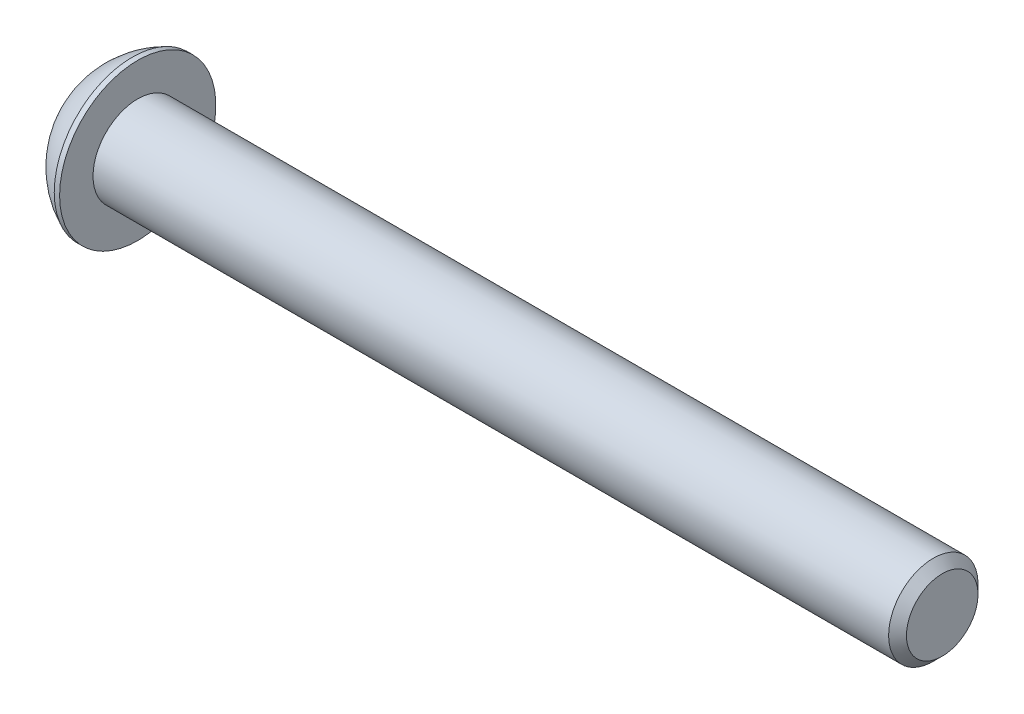
ISO-10303-21;
HEADER;
FILE_DESCRIPTION(('STEP AP214'),'2;1');
FILE_NAME('part.step','',(''),(''),'','','');
FILE_SCHEMA(('AUTOMOTIVE_DESIGN { 1 0 10303 214 1 1 1 1 }'));
ENDSEC;
DATA;
#1=APPLICATION_CONTEXT('core data for automotive mechanical design processes');
#2=APPLICATION_PROTOCOL_DEFINITION('international standard','automotive_design',2000,#1);
#3=PRODUCT_CONTEXT('',#1,'mechanical');
#4=PRODUCT('Part','Part','',(#3));
#5=PRODUCT_RELATED_PRODUCT_CATEGORY('part','',(#4));
#6=PRODUCT_DEFINITION_FORMATION('','',#4);
#7=PRODUCT_DEFINITION_CONTEXT('part definition',#1,'design');
#8=PRODUCT_DEFINITION('design','',#6,#7);
#9=PRODUCT_DEFINITION_SHAPE('','',#8);
#10=(LENGTH_UNIT() NAMED_UNIT(*) SI_UNIT(.MILLI.,.METRE.));
#11=(NAMED_UNIT(*) PLANE_ANGLE_UNIT() SI_UNIT($,.RADIAN.));
#12=(NAMED_UNIT(*) SI_UNIT($,.STERADIAN.) SOLID_ANGLE_UNIT());
#13=UNCERTAINTY_MEASURE_WITH_UNIT(LENGTH_MEASURE(1.E-05),#10,'distance_accuracy_value','');
#14=(GEOMETRIC_REPRESENTATION_CONTEXT(3) GLOBAL_UNCERTAINTY_ASSIGNED_CONTEXT((#13)) GLOBAL_UNIT_ASSIGNED_CONTEXT((#10,
#11,#12)) REPRESENTATION_CONTEXT('',''));
#15=CARTESIAN_POINT('',(0.,0.,0.));
#16=DIRECTION('',(0.,0.,1.));
#17=DIRECTION('',(1.,0.,0.));
#18=AXIS2_PLACEMENT_3D('',#15,#16,#17);
#19=CARTESIAN_POINT('',(1.32080000000034,0.,0.));
#20=DIRECTION('',(-1.,0.,0.));
#21=DIRECTION('',(0.,0.,1.));
#22=AXIS2_PLACEMENT_3D('',#19,#20,#21);
#23=CONICAL_SURFACE('',#22,1.1937999999998,1.04719755119608);
#24=CARTESIAN_POINT('',(2.01004075135902,0.,-4.44089209850063E-13));
#25=VERTEX_POINT('',#24);
#26=VERTEX_LOOP('',#25);
#27=FACE_BOUND('',#26,.T.);
#28=CARTESIAN_POINT('',(1.32080000000009,0.,0.));
#29=DIRECTION('',(-1.,0.,0.));
#30=DIRECTION('',(0.,0.,1.));
#31=AXIS2_PLACEMENT_3D('',#28,#29,#30);
#32=CIRCLE('',#31,1.19380000000024);
#33=CARTESIAN_POINT('',(1.32080000000009,0.,1.19380000000024));
#34=VERTEX_POINT('',#33);
#35=EDGE_CURVE('E20',#34,#34,#32,.T.);
#36=ORIENTED_EDGE('',*,*,#35,.T.);
#37=EDGE_LOOP('',(#36));
#38=FACE_BOUND('',#37,.T.);
#39=ADVANCED_FACE('F17',(#27,#38),#23,.F.);
#40=CARTESIAN_POINT('',(1.3208,-2.29135888084633,0.));
#41=DIRECTION('',(1.,0.,0.));
#42=DIRECTION('',(0.,0.,-1.));
#43=AXIS2_PLACEMENT_3D('',#40,#41,#42);
#44=PLANE('',#43);
#45=DIRECTION('',(0.,1.,0.));
#46=VECTOR('',#45,1.);
#47=CARTESIAN_POINT('',(1.3208,-1.14567944042316,1.984375));
#48=LINE('',#47,#46);
#49=CARTESIAN_POINT('',(1.3208,1.14567944042316,1.984375));
#50=VERTEX_POINT('',#49);
#51=CARTESIAN_POINT('',(1.3208,-1.14567944042316,1.984375));
#52=VERTEX_POINT('',#51);
#53=EDGE_CURVE('E69',#50,#52,#48,.F.);
#54=ORIENTED_EDGE('',*,*,#53,.F.);
#55=DIRECTION('',(0.,0.5,-0.866025403784439));
#56=VECTOR('',#55,1.);
#57=CARTESIAN_POINT('',(1.3208,1.14567944042316,1.984375));
#58=LINE('',#57,#56);
#59=CARTESIAN_POINT('',(1.3208,2.29135888084633,0.));
#60=VERTEX_POINT('',#59);
#61=EDGE_CURVE('E287',#60,#50,#58,.F.);
#62=ORIENTED_EDGE('',*,*,#61,.F.);
#63=DIRECTION('',(0.,-0.5,-0.866025403784439));
#64=VECTOR('',#63,1.);
#65=CARTESIAN_POINT('',(1.3208,2.29135888084633,0.));
#66=LINE('',#65,#64);
#67=CARTESIAN_POINT('',(1.3208,1.14567944042316,-1.984375));
#68=VERTEX_POINT('',#67);
#69=EDGE_CURVE('E291',#68,#60,#66,.F.);
#70=ORIENTED_EDGE('',*,*,#69,.F.);
#71=DIRECTION('',(0.,1.,0.));
#72=VECTOR('',#71,1.);
#73=CARTESIAN_POINT('',(1.3208,1.14567944042316,-1.984375));
#74=LINE('',#73,#72);
#75=CARTESIAN_POINT('',(1.3208,-1.14567944042316,-1.984375));
#76=VERTEX_POINT('',#75);
#77=EDGE_CURVE('E296',#76,#68,#74,.T.);
#78=ORIENTED_EDGE('',*,*,#77,.F.);
#79=DIRECTION('',(0.,-0.500000000000001,0.866025403784438));
#80=VECTOR('',#79,1.);
#81=CARTESIAN_POINT('',(1.3208,-1.14567944042316,-1.984375));
#82=LINE('',#81,#80);
#83=CARTESIAN_POINT('',(1.3208,-2.29135888084633,0.));
#84=VERTEX_POINT('',#83);
#85=EDGE_CURVE('E301',#84,#76,#82,.F.);
#86=ORIENTED_EDGE('',*,*,#85,.F.);
#87=DIRECTION('',(0.,0.500000000000001,0.866025403784438));
#88=VECTOR('',#87,1.);
#89=CARTESIAN_POINT('',(1.3208,-2.29135888084633,0.));
#90=LINE('',#89,#88);
#91=EDGE_CURVE('E82',#52,#84,#90,.F.);
#92=ORIENTED_EDGE('',*,*,#91,.F.);
#93=EDGE_LOOP('',(#54,#62,#70,#78,#86,#92));
#94=FACE_BOUND('',#93,.T.);
#95=ORIENTED_EDGE('',*,*,#35,.F.);
#96=EDGE_LOOP('',(#95));
#97=FACE_BOUND('',#96,.T.);
#98=ADVANCED_FACE('F75',(#94,#97),#44,.F.);
#99=CARTESIAN_POINT('',(1.3208,-1.14567944042316,1.984375));
#100=DIRECTION('',(0.,0.,-1.));
#101=DIRECTION('',(0.,1.,0.));
#102=AXIS2_PLACEMENT_3D('',#99,#100,#101);
#103=PLANE('',#102);
#104=ORIENTED_EDGE('',*,*,#53,.T.);
#105=DIRECTION('',(1.,0.,0.));
#106=VECTOR('',#105,1.);
#107=CARTESIAN_POINT('',(1.3208,-1.14567944042316,1.984375));
#108=LINE('',#107,#106);
#109=CARTESIAN_POINT('',(0.,-1.14567944042316,1.984375));
#110=VERTEX_POINT('',#109);
#111=EDGE_CURVE('E79',#110,#52,#108,.T.);
#112=ORIENTED_EDGE('',*,*,#111,.F.);
#113=DIRECTION('',(0.,1.,0.));
#114=VECTOR('',#113,1.);
#115=CARTESIAN_POINT('',(0.,0.,1.984375));
#116=LINE('',#115,#114);
#117=CARTESIAN_POINT('',(0.,1.14567944042316,1.984375));
#118=VERTEX_POINT('',#117);
#119=EDGE_CURVE('E281',#118,#110,#116,.F.);
#120=ORIENTED_EDGE('',*,*,#119,.F.);
#121=DIRECTION('',(1.,0.,0.));
#122=VECTOR('',#121,1.);
#123=CARTESIAN_POINT('',(1.3208,1.14567944042316,1.984375));
#124=LINE('',#123,#122);
#125=EDGE_CURVE('E284',#50,#118,#124,.F.);
#126=ORIENTED_EDGE('',*,*,#125,.F.);
#127=EDGE_LOOP('',(#104,#112,#120,#126));
#128=FACE_BOUND('',#127,.T.);
#129=ADVANCED_FACE('F128',(#128),#103,.T.);
#130=CARTESIAN_POINT('',(1.3208,-2.29135888084633,0.));
#131=DIRECTION('',(0.,0.866025403784438,-0.500000000000001));
#132=DIRECTION('',(0.,0.500000000000001,0.866025403784438));
#133=AXIS2_PLACEMENT_3D('',#130,#131,#132);
#134=PLANE('',#133);
#135=ORIENTED_EDGE('',*,*,#91,.T.);
#136=DIRECTION('',(1.,0.,0.));
#137=VECTOR('',#136,1.);
#138=CARTESIAN_POINT('',(1.3208,-2.29135888084633,0.));
#139=LINE('',#138,#137);
#140=CARTESIAN_POINT('',(0.,-2.29135888084633,0.));
#141=VERTEX_POINT('',#140);
#142=EDGE_CURVE('E303',#141,#84,#139,.T.);
#143=ORIENTED_EDGE('',*,*,#142,.F.);
#144=DIRECTION('',(0.,-0.500000000000001,-0.866025403784438));
#145=VECTOR('',#144,1.);
#146=CARTESIAN_POINT('',(0.,-1.14567944042316,1.984375));
#147=LINE('',#146,#145);
#148=EDGE_CURVE('E278',#110,#141,#147,.T.);
#149=ORIENTED_EDGE('',*,*,#148,.F.);
#150=ORIENTED_EDGE('',*,*,#111,.T.);
#151=EDGE_LOOP('',(#135,#143,#149,#150));
#152=FACE_BOUND('',#151,.T.);
#153=ADVANCED_FACE('F124',(#152),#134,.T.);
#154=CARTESIAN_POINT('',(1.3208,-1.14567944042316,-1.984375));
#155=DIRECTION('',(0.,0.866025403784438,0.500000000000001));
#156=DIRECTION('',(0.,-0.500000000000001,0.866025403784438));
#157=AXIS2_PLACEMENT_3D('',#154,#155,#156);
#158=PLANE('',#157);
#159=ORIENTED_EDGE('',*,*,#85,.T.);
#160=DIRECTION('',(1.,0.,0.));
#161=VECTOR('',#160,1.);
#162=CARTESIAN_POINT('',(1.3208,-1.14567944042316,-1.984375));
#163=LINE('',#162,#161);
#164=CARTESIAN_POINT('',(0.,-1.14567944042316,-1.984375));
#165=VERTEX_POINT('',#164);
#166=EDGE_CURVE('E298',#165,#76,#163,.T.);
#167=ORIENTED_EDGE('',*,*,#166,.F.);
#168=DIRECTION('',(0.,0.500000000000001,-0.866025403784438));
#169=VECTOR('',#168,1.);
#170=CARTESIAN_POINT('',(0.,-2.29135888084633,0.));
#171=LINE('',#170,#169);
#172=EDGE_CURVE('E275',#141,#165,#171,.T.);
#173=ORIENTED_EDGE('',*,*,#172,.F.);
#174=ORIENTED_EDGE('',*,*,#142,.T.);
#175=EDGE_LOOP('',(#159,#167,#173,#174));
#176=FACE_BOUND('',#175,.T.);
#177=ADVANCED_FACE('F120',(#176),#158,.T.);
#178=CARTESIAN_POINT('',(1.3208,1.14567944042316,-1.984375));
#179=DIRECTION('',(0.,0.,1.));
#180=DIRECTION('',(1.,0.,0.));
#181=AXIS2_PLACEMENT_3D('',#178,#179,#180);
#182=PLANE('',#181);
#183=ORIENTED_EDGE('',*,*,#77,.T.);
#184=DIRECTION('',(1.,0.,0.));
#185=VECTOR('',#184,1.);
#186=CARTESIAN_POINT('',(1.3208,1.14567944042316,-1.984375));
#187=LINE('',#186,#185);
#188=CARTESIAN_POINT('',(0.,1.14567944042316,-1.984375));
#189=VERTEX_POINT('',#188);
#190=EDGE_CURVE('E293',#189,#68,#187,.T.);
#191=ORIENTED_EDGE('',*,*,#190,.F.);
#192=DIRECTION('',(0.,1.,0.));
#193=VECTOR('',#192,1.);
#194=CARTESIAN_POINT('',(0.,0.,-1.984375));
#195=LINE('',#194,#193);
#196=EDGE_CURVE('E272',#165,#189,#195,.T.);
#197=ORIENTED_EDGE('',*,*,#196,.F.);
#198=ORIENTED_EDGE('',*,*,#166,.T.);
#199=EDGE_LOOP('',(#183,#191,#197,#198));
#200=FACE_BOUND('',#199,.T.);
#201=ADVANCED_FACE('F117',(#200),#182,.T.);
#202=CARTESIAN_POINT('',(1.3208,2.29135888084633,0.));
#203=DIRECTION('',(0.,-0.866025403784439,0.5));
#204=DIRECTION('',(0.,-0.5,-0.866025403784439));
#205=AXIS2_PLACEMENT_3D('',#202,#203,#204);
#206=PLANE('',#205);
#207=ORIENTED_EDGE('',*,*,#69,.T.);
#208=DIRECTION('',(1.,0.,0.));
#209=VECTOR('',#208,1.);
#210=CARTESIAN_POINT('',(1.3208,2.29135888084633,0.));
#211=LINE('',#210,#209);
#212=CARTESIAN_POINT('',(0.,2.29135888084633,0.));
#213=VERTEX_POINT('',#212);
#214=EDGE_CURVE('E35',#213,#60,#211,.T.);
#215=ORIENTED_EDGE('',*,*,#214,.F.);
#216=DIRECTION('',(0.,0.5,0.866025403784439));
#217=VECTOR('',#216,1.);
#218=CARTESIAN_POINT('',(0.,1.14567944042316,-1.984375));
#219=LINE('',#218,#217);
#220=EDGE_CURVE('E269',#189,#213,#219,.T.);
#221=ORIENTED_EDGE('',*,*,#220,.F.);
#222=ORIENTED_EDGE('',*,*,#190,.T.);
#223=EDGE_LOOP('',(#207,#215,#221,#222));
#224=FACE_BOUND('',#223,.T.);
#225=ADVANCED_FACE('F113',(#224),#206,.T.);
#226=CARTESIAN_POINT('',(1.3208,1.14567944042316,1.984375));
#227=DIRECTION('',(0.,-0.866025403784439,-0.5));
#228=DIRECTION('',(0.,0.5,-0.866025403784439));
#229=AXIS2_PLACEMENT_3D('',#226,#227,#228);
#230=PLANE('',#229);
#231=ORIENTED_EDGE('',*,*,#61,.T.);
#232=ORIENTED_EDGE('',*,*,#125,.T.);
#233=DIRECTION('',(0.,-0.5,0.866025403784438));
#234=VECTOR('',#233,1.);
#235=CARTESIAN_POINT('',(0.,2.29135888084633,0.));
#236=LINE('',#235,#234);
#237=EDGE_CURVE('E100',#213,#118,#236,.T.);
#238=ORIENTED_EDGE('',*,*,#237,.F.);
#239=ORIENTED_EDGE('',*,*,#214,.T.);
#240=EDGE_LOOP('',(#231,#232,#238,#239));
#241=FACE_BOUND('',#240,.T.);
#242=ADVANCED_FACE('F109',(#241),#230,.T.);
#243=CARTESIAN_POINT('',(0.,0.,0.));
#244=DIRECTION('',(-1.,0.,0.));
#245=DIRECTION('',(0.,0.,1.));
#246=AXIS2_PLACEMENT_3D('',#243,#244,#245);
#247=PLANE('',#246);
#248=ORIENTED_EDGE('',*,*,#220,.T.);
#249=ORIENTED_EDGE('',*,*,#237,.T.);
#250=ORIENTED_EDGE('',*,*,#119,.T.);
#251=ORIENTED_EDGE('',*,*,#148,.T.);
#252=ORIENTED_EDGE('',*,*,#172,.T.);
#253=ORIENTED_EDGE('',*,*,#196,.T.);
#254=EDGE_LOOP('',(#248,#249,#250,#251,#252,#253));
#255=FACE_BOUND('',#254,.T.);
#256=CARTESIAN_POINT('',(0.,2.77495,0.));
#257=CARTESIAN_POINT('',(0.,2.77494953309947,0.0779118937523459));
#258=CARTESIAN_POINT('',(0.,2.77166578388025,0.15583810591977));
#259=CARTESIAN_POINT('',(0.,2.75855213600204,0.311152012455904));
#260=CARTESIAN_POINT('',(0.,2.74872030471467,0.388539541019556));
#261=CARTESIAN_POINT('',(0.,2.72255472645676,0.542341518735717));
#262=CARTESIAN_POINT('',(-2.70414110576258E-13,2.70621065843663,0.618754223567578));
#263=CARTESIAN_POINT('',(2.71501725221868E-13,2.66713326915777,0.769973634286023));
#264=CARTESIAN_POINT('',(1.01274952524446E-12,2.64439476297869,0.844778983646282));
#265=CARTESIAN_POINT('',(1.81909959813207E-12,2.56690195943351,1.06566239301792));
#266=CARTESIAN_POINT('',(4.77081687541822E-13,2.50280672569928,1.20857954243987));
#267=CARTESIAN_POINT('',(-4.76232447128612E-13,2.35149826934097,1.48160874561538));
#268=CARTESIAN_POINT('',(0.,2.26428416790397,1.61172031233499));
#269=CARTESIAN_POINT('',(0.,2.1181093928834,1.79445660654268));
#270=CARTESIAN_POINT('',(0.,2.06678693791626,1.85333128513996));
#271=CARTESIAN_POINT('',(0.,1.95940522984449,1.96650727912792));
#272=CARTESIAN_POINT('',(0.,1.90335059143535,2.02081294920044));
#273=CARTESIAN_POINT('',(0.,1.78683891013963,2.12453280878582));
#274=CARTESIAN_POINT('',(0.,1.72637988450322,2.1739447713554));
#275=CARTESIAN_POINT('',(0.,1.60151968865711,2.26750481692908));
#276=CARTESIAN_POINT('',(0.,1.53711760864537,2.31165167810847));
#277=CARTESIAN_POINT('',(0.,1.33869902291632,2.43567242603944));
#278=CARTESIAN_POINT('',(0.,1.19934704110695,2.507235886628));
#279=CARTESIAN_POINT('',(0.,0.910681609121881,2.62590828672821));
#280=CARTESIAN_POINT('',(0.,0.761368265357398,2.67301748742278));
#281=CARTESIAN_POINT('',(0.,0.456932649466623,2.74151230664007));
#282=CARTESIAN_POINT('',(0.,0.301810346322584,2.76289778778721));
#283=CARTESIAN_POINT('',(0.,-0.00982263870895171,2.77931595661156));
#284=CARTESIAN_POINT('',(0.,-0.166333320596448,2.77434864428877));
#285=CARTESIAN_POINT('',(0.,-0.476280836814452,2.73822217653073));
#286=CARTESIAN_POINT('',(0.,-0.629717687555985,2.70706316096981));
#287=CARTESIAN_POINT('',(0.,-0.929254830044274,2.61937980771149));
#288=CARTESIAN_POINT('',(0.,-1.0753550434132,2.56285519909568));
#289=CARTESIAN_POINT('',(0.,-1.28570692598579,2.46037024128109));
#290=CARTESIAN_POINT('',(0.,-1.35439130022287,2.42323494812896));
#291=CARTESIAN_POINT('',(0.,-1.488391287199,2.34331277270256));
#292=CARTESIAN_POINT('',(0.,-1.55370767631787,2.30052720108831));
#293=CARTESIAN_POINT('',(0.,-1.68047292776594,2.20962421887055));
#294=CARTESIAN_POINT('',(0.,-1.7419235278682,2.16150923122348));
#295=CARTESIAN_POINT('',(0.,-1.86060297067992,2.06024311301283));
#296=CARTESIAN_POINT('',(0.,-1.91782768181715,2.0070871669763));
#297=CARTESIAN_POINT('',(0.,-2.08239462196651,1.8407220856554));
#298=CARTESIAN_POINT('',(0.,-2.18279764272601,1.72049499758422));
#299=CARTESIAN_POINT('',(0.,-2.36195754944063,1.46487629213018));
#300=CARTESIAN_POINT('',(0.,-2.44071525816758,1.32948525142807));
#301=CARTESIAN_POINT('',(0.,-2.54098882695274,1.11796734074395));
#302=CARTESIAN_POINT('',(0.,-2.57146177392727,1.04596540008347));
#303=CARTESIAN_POINT('',(0.,-2.62621251108999,0.899689259475764));
#304=CARTESIAN_POINT('',(0.,-2.65049531495563,0.825416953360952));
#305=CARTESIAN_POINT('',(0.,-2.69267708798766,0.675215808695207));
#306=CARTESIAN_POINT('',(0.,-2.71058613777937,0.599289789313092));
#307=CARTESIAN_POINT('',(0.,-2.73994710360127,0.446213628496932));
#308=CARTESIAN_POINT('',(0.,-2.75140092413871,0.369063855024788));
#309=CARTESIAN_POINT('',(0.,-2.76470470685522,0.24316208817343));
#310=CARTESIAN_POINT('',(0.,-2.76854547596618,0.194611672428577));
#311=CARTESIAN_POINT('',(0.,-2.77366826843264,0.0973760351839812));
#312=CARTESIAN_POINT('',(0.,-2.77495029178814,0.0486908136842395));
#313=CARTESIAN_POINT('',(0.,-2.77494953309947,-0.0779118937523475));
#314=CARTESIAN_POINT('',(0.,-2.77166578388025,-0.155838105919772));
#315=CARTESIAN_POINT('',(0.,-2.75855213600204,-0.311152012455906));
#316=CARTESIAN_POINT('',(0.,-2.74872030471467,-0.388539541019558));
#317=CARTESIAN_POINT('',(0.,-2.72255472645677,-0.542341518735719));
#318=CARTESIAN_POINT('',(-2.70149297926331E-13,-2.70621065843663,-0.61875422356758));
#319=CARTESIAN_POINT('',(2.712366972268E-13,-2.66713326915777,-0.769973634286024));
#320=CARTESIAN_POINT('',(1.0114146773846E-12,-2.64439476297869,-0.844778983646283));
#321=CARTESIAN_POINT('',(1.81656702958366E-12,-2.5669019594335,-1.06566239301792));
#322=CARTESIAN_POINT('',(4.7641829195856E-13,-2.50280672569928,-1.20857954243988));
#323=CARTESIAN_POINT('',(-4.75569026324205E-13,-2.35149826934097,-1.48160874561538));
#324=CARTESIAN_POINT('',(0.,-2.26428416790396,-1.61172031233499));
#325=CARTESIAN_POINT('',(0.,-2.1181093928834,-1.79445660654268));
#326=CARTESIAN_POINT('',(0.,-2.06678693791626,-1.85333128513997));
#327=CARTESIAN_POINT('',(0.,-1.95940522984449,-1.96650727912792));
#328=CARTESIAN_POINT('',(0.,-1.90335059143535,-2.02081294920044));
#329=CARTESIAN_POINT('',(0.,-1.78683891013963,-2.12453280878582));
#330=CARTESIAN_POINT('',(0.,-1.72637988450322,-2.1739447713554));
#331=CARTESIAN_POINT('',(0.,-1.60151968865711,-2.26750481692908));
#332=CARTESIAN_POINT('',(0.,-1.53711760864537,-2.31165167810847));
#333=CARTESIAN_POINT('',(0.,-1.33869902291632,-2.43567242603944));
#334=CARTESIAN_POINT('',(0.,-1.19934704110695,-2.507235886628));
#335=CARTESIAN_POINT('',(0.,-0.91068160912188,-2.62590828672821));
#336=CARTESIAN_POINT('',(0.,-0.761368265357396,-2.67301748742278));
#337=CARTESIAN_POINT('',(0.,-0.456932649466621,-2.74151230664007));
#338=CARTESIAN_POINT('',(0.,-0.301810346322582,-2.76289778778721));
#339=CARTESIAN_POINT('',(0.,0.00982263870895353,-2.77931595661156));
#340=CARTESIAN_POINT('',(0.,0.16633332059645,-2.77434864428876));
#341=CARTESIAN_POINT('',(0.,0.476280836814454,-2.73822217653073));
#342=CARTESIAN_POINT('',(0.,0.629717687555987,-2.70706316096981));
#343=CARTESIAN_POINT('',(0.,0.929254830044276,-2.6193798077115));
#344=CARTESIAN_POINT('',(0.,1.0753550434132,-2.56285519909568));
#345=CARTESIAN_POINT('',(0.,1.28570692598579,-2.46037024128109));
#346=CARTESIAN_POINT('',(0.,1.35439130022287,-2.42323494812896));
#347=CARTESIAN_POINT('',(0.,1.488391287199,-2.34331277270256));
#348=CARTESIAN_POINT('',(0.,1.55370767631787,-2.30052720108831));
#349=CARTESIAN_POINT('',(0.,1.68047292776594,-2.20962421887055));
#350=CARTESIAN_POINT('',(0.,1.7419235278682,-2.16150923122348));
#351=CARTESIAN_POINT('',(0.,1.86060297067992,-2.06024311301282));
#352=CARTESIAN_POINT('',(0.,1.91782768181716,-2.0070871669763));
#353=CARTESIAN_POINT('',(0.,2.08239462196651,-1.8407220856554));
#354=CARTESIAN_POINT('',(0.,2.18279764272601,-1.72049499758422));
#355=CARTESIAN_POINT('',(0.,2.36195754944063,-1.46487629213018));
#356=CARTESIAN_POINT('',(0.,2.44071525816757,-1.32948525142807));
#357=CARTESIAN_POINT('',(0.,2.54098882695273,-1.11796734074395));
#358=CARTESIAN_POINT('',(0.,2.57146177392727,-1.04596540008347));
#359=CARTESIAN_POINT('',(0.,2.62621251108999,-0.899689259475765));
#360=CARTESIAN_POINT('',(0.,2.65049531495563,-0.825416953360953));
#361=CARTESIAN_POINT('',(0.,2.69267708798766,-0.675215808695207));
#362=CARTESIAN_POINT('',(0.,2.71058613777936,-0.599289789313092));
#363=CARTESIAN_POINT('',(0.,2.73994710360127,-0.446213628496932));
#364=CARTESIAN_POINT('',(0.,2.75140092413871,-0.369063855024789));
#365=CARTESIAN_POINT('',(0.,2.76470470685522,-0.243162088173432));
#366=CARTESIAN_POINT('',(0.,2.76854547596618,-0.194611672428578));
#367=CARTESIAN_POINT('',(0.,2.77366826843264,-0.0973760351839823));
#368=CARTESIAN_POINT('',(0.,2.77495029178814,-0.0486908136842408));
#369=CARTESIAN_POINT('',(0.,2.77495,0.));
#370=B_SPLINE_CURVE_WITH_KNOTS('',3,(#256,#257,#258,#259,#260,#261,#262,#263,#264,#265,#266,
#267,#268,#269,#270,#271,#272,#273,#274,#275,#276,#277,#278,#279,#280,#281,#282,#283,#284,#285,
#286,#287,#288,#289,#290,#291,#292,#293,#294,#295,#296,#297,#298,#299,#300,#301,#302,#303,#304,
#305,#306,#307,#308,#309,#310,#311,#312,#313,#314,#315,#316,#317,#318,#319,#320,#321,#322,#323,
#324,#325,#326,#327,#328,#329,#330,#331,#332,#333,#334,#335,#336,#337,#338,#339,#340,#341,#342,
#343,#344,#345,#346,#347,#348,#349,#350,#351,#352,#353,#354,#355,#356,#357,#358,#359,#360,#361,
#362,#363,#364,#365,#366,#367,#368,#369),.UNSPECIFIED.,.T.,.F.,(4,2,2,2,2,2,2,2,2,2,2,2,2,2,2,2,
2,2,2,2,2,2,2,2,2,2,2,2,2,2,2,2,2,2,2,2,2,2,2,2,2,2,2,2,2,2,2,2,2,2,2,2,2,2,2,2,4),(0.,
0.233690856748162,0.467450716578751,0.701582538521471,0.935904756015414,1.40343220467667,
1.87097742791502,2.10505636898837,2.33890962270652,2.57286880998746,2.80688218486306,
3.27442101763127,3.74195485676357,4.20949119271389,4.67702752866417,5.14456136779641,
5.61210020056468,5.84611357544033,6.08007276272136,6.31392601643949,6.54800495751273,
7.01555018075072,7.48307762941212,7.71739984690652,7.95153166884955,8.18529152868023,
8.41898238542855,8.56502681353347,8.71107124163843,8.94476209838659,9.17852195821718,
9.4126537801599,9.64697599765384,10.1145034463151,10.5820486695534,10.8161276106268,
11.0499808643449,11.2839400516259,11.5179534265015,11.9854922592697,12.453026098402,
12.9205624343523,13.3880987703026,13.8556326094348,14.3231714422031,14.5571848170788,
14.7911440043598,15.0249972580779,15.2590761991512,15.7266214223891,16.1941488710506,
16.4284710885449,16.662602910488,16.8963627703186,17.130053627067,17.2760980551719,
17.4221424832769),.UNSPECIFIED.);
#371=CARTESIAN_POINT('',(0.,2.77495,0.));
#372=VERTEX_POINT('',#371);
#373=EDGE_CURVE('E94',#372,#372,#370,.T.);
#374=ORIENTED_EDGE('',*,*,#373,.F.);
#375=EDGE_LOOP('',(#374));
#376=FACE_BOUND('',#375,.T.);
#377=ADVANCED_FACE('F105',(#255,#376),#247,.T.);
#378=CARTESIAN_POINT('',(5.37260881410256,0.,0.));
#379=DIRECTION('',(0.,1.,0.));
#380=DIRECTION('',(1.,0.,0.));
#381=AXIS2_PLACEMENT_3D('',#378,#379,#380);
#382=SPHERICAL_SURFACE('',#381,6.04692260342999);
#383=CARTESIAN_POINT('',(2.9718,0.,0.));
#384=DIRECTION('',(-1.,0.,0.));
#385=DIRECTION('',(0.,0.,1.));
#386=AXIS2_PLACEMENT_3D('',#383,#384,#385);
#387=CIRCLE('',#386,5.5499);
#388=CARTESIAN_POINT('',(2.9718,0.,5.5499));
#389=VERTEX_POINT('',#388);
#390=EDGE_CURVE('E92',#389,#389,#387,.F.);
#391=ORIENTED_EDGE('',*,*,#390,.F.);
#392=EDGE_LOOP('',(#391));
#393=FACE_BOUND('',#392,.T.);
#394=ORIENTED_EDGE('',*,*,#373,.T.);
#395=EDGE_LOOP('',(#394));
#396=FACE_BOUND('',#395,.T.);
#397=ADVANCED_FACE('F101',(#393,#396),#382,.T.);
#398=CARTESIAN_POINT('',(60.5028,0.,0.));
#399=DIRECTION('',(-1.,0.,0.));
#400=DIRECTION('',(0.,0.,1.));
#401=AXIS2_PLACEMENT_3D('',#398,#399,#400);
#402=PLANE('',#401);
#403=CARTESIAN_POINT('',(60.5028000000516,0.,0.));
#404=DIRECTION('',(-1.,0.,0.));
#405=DIRECTION('',(0.,0.,1.));
#406=AXIS2_PLACEMENT_3D('',#403,#404,#405);
#407=CIRCLE('',#406,2.54000000001042);
#408=CARTESIAN_POINT('',(60.5028000000516,0.,2.54000000001042));
#409=VERTEX_POINT('',#408);
#410=EDGE_CURVE('E89',#409,#409,#407,.T.);
#411=ORIENTED_EDGE('',*,*,#410,.F.);
#412=EDGE_LOOP('',(#411));
#413=FACE_BOUND('',#412,.T.);
#414=ADVANCED_FACE('F154',(#413),#402,.F.);
#415=CARTESIAN_POINT('',(0.,0.,0.));
#416=DIRECTION('',(-1.,0.,0.));
#417=DIRECTION('',(0.,0.,1.));
#418=AXIS2_PLACEMENT_3D('',#415,#416,#417);
#419=CYLINDRICAL_SURFACE('',#418,5.5499);
#420=ORIENTED_EDGE('',*,*,#390,.T.);
#421=EDGE_LOOP('',(#420));
#422=FACE_BOUND('',#421,.T.);
#423=CARTESIAN_POINT('',(3.3528,0.,0.));
#424=DIRECTION('',(-1.,0.,0.));
#425=DIRECTION('',(0.,0.,1.));
#426=AXIS2_PLACEMENT_3D('',#423,#424,#425);
#427=CIRCLE('',#426,5.5499);
#428=CARTESIAN_POINT('',(3.3528,0.,5.5499));
#429=VERTEX_POINT('',#428);
#430=EDGE_CURVE('E86',#429,#429,#427,.T.);
#431=ORIENTED_EDGE('',*,*,#430,.T.);
#432=EDGE_LOOP('',(#431));
#433=FACE_BOUND('',#432,.T.);
#434=ADVANCED_FACE('F151',(#422,#433),#419,.T.);
#435=CARTESIAN_POINT('',(59.8678000000064,0.,0.));
#436=DIRECTION('',(-1.,0.,0.));
#437=DIRECTION('',(0.,0.,1.));
#438=AXIS2_PLACEMENT_3D('',#435,#436,#437);
#439=CONICAL_SURFACE('',#438,3.17500000005566,0.785398163397448);
#440=CARTESIAN_POINT('',(59.8678,0.,0.));
#441=DIRECTION('',(-1.,0.,0.));
#442=DIRECTION('',(0.,0.,1.));
#443=AXIS2_PLACEMENT_3D('',#440,#441,#442);
#444=CIRCLE('',#443,3.175);
#445=CARTESIAN_POINT('',(59.8678,0.,3.175));
#446=VERTEX_POINT('',#445);
#447=EDGE_CURVE('E26',#446,#446,#444,.T.);
#448=ORIENTED_EDGE('',*,*,#447,.F.);
#449=EDGE_LOOP('',(#448));
#450=FACE_BOUND('',#449,.T.);
#451=ORIENTED_EDGE('',*,*,#410,.T.);
#452=EDGE_LOOP('',(#451));
#453=FACE_BOUND('',#452,.T.);
#454=ADVANCED_FACE('F144',(#450,#453),#439,.T.);
#455=CARTESIAN_POINT('',(3.3528,3.175,0.));
#456=DIRECTION('',(-1.,0.,0.));
#457=DIRECTION('',(0.,0.,1.));
#458=AXIS2_PLACEMENT_3D('',#455,#456,#457);
#459=PLANE('',#458);
#460=CARTESIAN_POINT('',(3.3528,0.,0.));
#461=DIRECTION('',(-1.,0.,0.));
#462=DIRECTION('',(0.,0.,1.));
#463=AXIS2_PLACEMENT_3D('',#460,#461,#462);
#464=CIRCLE('',#463,3.175);
#465=CARTESIAN_POINT('',(3.3528,0.,3.175));
#466=VERTEX_POINT('',#465);
#467=EDGE_CURVE('E11',#466,#466,#464,.F.);
#468=ORIENTED_EDGE('',*,*,#467,.F.);
#469=EDGE_LOOP('',(#468));
#470=FACE_BOUND('',#469,.T.);
#471=ORIENTED_EDGE('',*,*,#430,.F.);
#472=EDGE_LOOP('',(#471));
#473=FACE_BOUND('',#472,.T.);
#474=ADVANCED_FACE('F138',(#470,#473),#459,.F.);
#475=CARTESIAN_POINT('',(0.,0.,0.));
#476=DIRECTION('',(-1.,0.,0.));
#477=DIRECTION('',(0.,0.,1.));
#478=AXIS2_PLACEMENT_3D('',#475,#476,#477);
#479=CYLINDRICAL_SURFACE('',#478,3.175);
#480=ORIENTED_EDGE('',*,*,#467,.T.);
#481=EDGE_LOOP('',(#480));
#482=FACE_BOUND('',#481,.T.);
#483=ORIENTED_EDGE('',*,*,#447,.T.);
#484=EDGE_LOOP('',(#483));
#485=FACE_BOUND('',#484,.T.);
#486=ADVANCED_FACE('F136',(#482,#485),#479,.T.);
#487=CLOSED_SHELL('',(#39,#98,#129,#153,#177,#201,#225,#242,#377,#397,#414,#434,#454,#474,#486));
#488=MANIFOLD_SOLID_BREP('B1',#487);
#489=ADVANCED_BREP_SHAPE_REPRESENTATION('',(#18,#488),#14);
#490=SHAPE_DEFINITION_REPRESENTATION(#9,#489);
ENDSEC;
END-ISO-10303-21;
